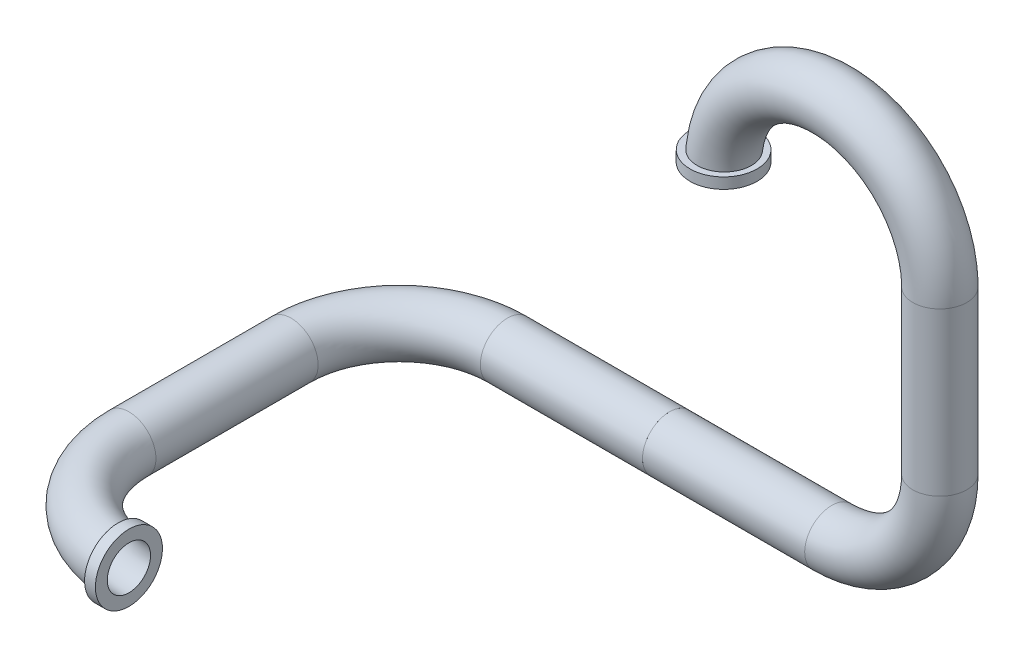
ISO-10303-21;
HEADER;
FILE_DESCRIPTION(('STEP AP214'),'2;1');
FILE_NAME('part.step','',(''),(''),'','','');
FILE_SCHEMA(('AUTOMOTIVE_DESIGN { 1 0 10303 214 1 1 1 1 }'));
ENDSEC;
DATA;
#1=APPLICATION_CONTEXT('core data for automotive mechanical design processes');
#2=APPLICATION_PROTOCOL_DEFINITION('international standard','automotive_design',2000,#1);
#3=PRODUCT_CONTEXT('',#1,'mechanical');
#4=PRODUCT('Part','Part','',(#3));
#5=PRODUCT_RELATED_PRODUCT_CATEGORY('part','',(#4));
#6=PRODUCT_DEFINITION_FORMATION('','',#4);
#7=PRODUCT_DEFINITION_CONTEXT('part definition',#1,'design');
#8=PRODUCT_DEFINITION('design','',#6,#7);
#9=PRODUCT_DEFINITION_SHAPE('','',#8);
#10=(LENGTH_UNIT() NAMED_UNIT(*) SI_UNIT(.MILLI.,.METRE.));
#11=(NAMED_UNIT(*) PLANE_ANGLE_UNIT() SI_UNIT($,.RADIAN.));
#12=(NAMED_UNIT(*) SI_UNIT($,.STERADIAN.) SOLID_ANGLE_UNIT());
#13=UNCERTAINTY_MEASURE_WITH_UNIT(LENGTH_MEASURE(1.E-05),#10,'distance_accuracy_value','');
#14=(GEOMETRIC_REPRESENTATION_CONTEXT(3) GLOBAL_UNCERTAINTY_ASSIGNED_CONTEXT((#13)) GLOBAL_UNIT_ASSIGNED_CONTEXT((#10,
#11,#12)) REPRESENTATION_CONTEXT('',''));
#15=CARTESIAN_POINT('',(0.,0.,0.));
#16=DIRECTION('',(0.,0.,1.));
#17=DIRECTION('',(1.,0.,0.));
#18=AXIS2_PLACEMENT_3D('',#15,#16,#17);
#19=CARTESIAN_POINT('',(-1.,-2.50000000000001,2.5));
#20=DIRECTION('',(0.,1.,0.));
#21=DIRECTION('',(-1.,0.,0.));
#22=AXIS2_PLACEMENT_3D('',#19,#20,#21);
#23=TOROIDAL_SURFACE('',#22,1.,0.25);
#24=CARTESIAN_POINT('',(-2.,-2.50000000000001,2.5));
#25=DIRECTION('',(0.,0.,-1.));
#26=DIRECTION('',(1.,0.,0.));
#27=AXIS2_PLACEMENT_3D('',#24,#25,#26);
#28=CIRCLE('',#27,0.25);
#29=CARTESIAN_POINT('',(-1.75,-2.50000000000001,2.5));
#30=VERTEX_POINT('',#29);
#31=EDGE_CURVE('E69',#30,#30,#28,.T.);
#32=ORIENTED_EDGE('',*,*,#31,.F.);
#33=EDGE_LOOP('',(#32));
#34=FACE_BOUND('',#33,.T.);
#35=CARTESIAN_POINT('',(-1.1,-2.34376036206096,3.29859890368239));
#36=CARTESIAN_POINT('',(-1.1,-2.33274792239043,3.30748461825524));
#37=CARTESIAN_POINT('',(-1.1,-2.32248108378372,3.31731154482602));
#38=CARTESIAN_POINT('',(-1.1,-2.30373626613945,3.33855979360369));
#39=CARTESIAN_POINT('',(-1.1,-2.2952606257197,3.34998316824432));
#40=CARTESIAN_POINT('',(-1.1,-2.28034940835712,3.37408196910666));
#41=CARTESIAN_POINT('',(-1.1,-2.27391241719741,3.386756519343));
#42=CARTESIAN_POINT('',(-1.1,-2.26325207779333,3.41300023448786));
#43=CARTESIAN_POINT('',(-1.1,-2.25902814904259,3.42656916374023));
#44=CARTESIAN_POINT('',(-1.1,-2.25289962356715,3.45426609808908));
#45=CARTESIAN_POINT('',(-1.1,-2.25100235576075,3.46839572582249));
#46=CARTESIAN_POINT('',(-1.1,-2.24960709556757,3.49677370794496));
#47=CARTESIAN_POINT('',(-1.1,-2.25010921596719,3.51102206788375));
#48=CARTESIAN_POINT('',(-1.1,-2.2535017844487,3.53922913334701));
#49=CARTESIAN_POINT('',(-1.1,-2.25639179422017,3.5531878915475));
#50=CARTESIAN_POINT('',(-1.1,-2.26448161295601,3.58041932555232));
#51=CARTESIAN_POINT('',(-1.1,-2.26968138537334,3.59369201220856));
#52=CARTESIAN_POINT('',(-1.1,-2.28222690286051,3.61913001861259));
#53=CARTESIAN_POINT('',(-1.1,-2.28956594273113,3.63129864492456));
#54=CARTESIAN_POINT('',(-1.1,-2.30619061124263,3.65422440361082));
#55=CARTESIAN_POINT('',(-1.1,-2.31547619579665,3.66498156794405));
#56=CARTESIAN_POINT('',(-1.1,-2.33569004284594,3.68473296660521));
#57=CARTESIAN_POINT('',(-1.1,-2.34661152471379,3.69373414042714));
#58=CARTESIAN_POINT('',(-1.1,-2.36981514135202,3.70976742880129));
#59=CARTESIAN_POINT('',(-1.1,-2.38209725081843,3.7167995799634));
#60=CARTESIAN_POINT('',(-1.1,-2.40762676961445,3.72866989147601));
#61=CARTESIAN_POINT('',(-1.1,-2.42087062920436,3.73351568693935));
#62=CARTESIAN_POINT('',(-1.1,-2.44798491254632,3.74090948117469));
#63=CARTESIAN_POINT('',(-1.1,-2.4618553272407,3.74345751315272));
#64=CARTESIAN_POINT('',(-1.1,-2.48979611503258,3.74617903253143));
#65=CARTESIAN_POINT('',(-1.1,-2.50386597816706,3.74635775803878));
#66=CARTESIAN_POINT('',(-1.1,-2.53183570922119,3.7443490557881));
#67=CARTESIAN_POINT('',(-1.1,-2.54573557814848,3.74216164206245));
#68=CARTESIAN_POINT('',(-1.1,-2.57296285317496,3.73548566564956));
#69=CARTESIAN_POINT('',(-1.1,-2.58629057651418,3.73099839651049));
#70=CARTESIAN_POINT('',(-1.1,-2.61200472240836,3.71985250641525));
#71=CARTESIAN_POINT('',(-1.1,-2.62439114251576,3.7131938798134));
#72=CARTESIAN_POINT('',(-1.1,-2.64788721829468,3.69788731542389));
#73=CARTESIAN_POINT('',(-1.1,-2.65899538312406,3.68923708938565));
#74=CARTESIAN_POINT('',(-1.1,-2.67960664012637,3.67019911655826));
#75=CARTESIAN_POINT('',(-1.1,-2.68910971416847,3.65981135014478));
#76=CARTESIAN_POINT('',(-1.1,-2.70626946017411,3.63756371948689));
#77=CARTESIAN_POINT('',(-1.1,-2.7139210530427,3.6256999380033));
#78=CARTESIAN_POINT('',(-1.1,-2.72713254176267,3.6008600065118));
#79=CARTESIAN_POINT('',(-1.1,-2.73269239879531,3.58788383586549));
#80=CARTESIAN_POINT('',(-1.1,-2.74158543201791,3.56113487356717));
#81=CARTESIAN_POINT('',(-1.1,-2.74491006219375,3.54735924079537));
#82=CARTESIAN_POINT('',(-1.1,-2.74920929927144,3.51944604647422));
#83=CARTESIAN_POINT('',(-1.1,-2.75018385138604,3.50530847649482));
#84=CARTESIAN_POINT('',(-1.1,-2.74975817198089,3.4770136765723));
#85=CARTESIAN_POINT('',(-1.1,-2.74834862586144,3.46285658644129));
#86=CARTESIAN_POINT('',(-1.1,-2.74317877425726,3.43497822630541));
#87=CARTESIAN_POINT('',(-1.1,-2.73941842480588,3.42125696445682));
#88=CARTESIAN_POINT('',(-1.1,-2.72964125391774,3.39460613735039));
#89=CARTESIAN_POINT('',(-1.1,-2.72361909393578,3.38167853001149));
#90=CARTESIAN_POINT('',(-1.1,-2.70948750509544,3.35701911324203));
#91=CARTESIAN_POINT('',(-1.1,-2.70137806627134,3.34528730952121));
#92=CARTESIAN_POINT('',(-1.1,-2.68330917267057,3.32337073898221));
#93=CARTESIAN_POINT('',(-1.1,-2.6733519643936,3.31318412058785));
#94=CARTESIAN_POINT('',(-1.1,-2.6518599490962,3.29463870405255));
#95=CARTESIAN_POINT('',(-1.1,-2.64032518394127,3.28627985742117));
#96=CARTESIAN_POINT('',(-1.1,-2.61607486461746,3.27168127958962));
#97=CARTESIAN_POINT('',(-1.1,-2.60336647310675,3.26542965254311));
#98=CARTESIAN_POINT('',(-1.1,-2.57707519918234,3.25516854334938));
#99=CARTESIAN_POINT('',(-1.1,-2.56349239667433,3.25115885665189));
#100=CARTESIAN_POINT('',(-1.1,-2.5359545442265,3.24552688282323));
#101=CARTESIAN_POINT('',(-1.1,-2.52200336275818,3.24388566967865));
#102=CARTESIAN_POINT('',(-1.1,-2.49402044732113,3.24298034692899));
#103=CARTESIAN_POINT('',(-1.1,-2.47998869639818,3.24371675742366));
#104=CARTESIAN_POINT('',(-1.1,-2.45230755732259,3.24753647692591));
#105=CARTESIAN_POINT('',(-1.1,-2.43865686179296,3.25061036534622));
#106=CARTESIAN_POINT('',(-1.1,-2.41207526720781,3.2589995811081));
#107=CARTESIAN_POINT('',(-1.1,-2.39914352376172,3.26431221334144));
#108=CARTESIAN_POINT('',(-1.1,-2.37913230447451,3.27456413039254));
#109=CARTESIAN_POINT('',(-1.1,-2.37171597351397,3.2788601779382));
#110=CARTESIAN_POINT('',(-1.1,-2.35736219612938,3.28818888620585));
#111=CARTESIAN_POINT('',(-1.1,-2.35042474856057,3.29322154516689));
#112=CARTESIAN_POINT('',(-1.1,-2.34376036206096,3.29859890368239));
#113=B_SPLINE_CURVE_WITH_KNOTS('',3,(#35,#36,#37,#38,#39,#40,#41,#42,#43,#44,#45,#46,#47,#48,
#49,#50,#51,#52,#53,#54,#55,#56,#57,#58,#59,#60,#61,#62,#63,#64,#65,#66,#67,#68,#69,#70,#71,#72,
#73,#74,#75,#76,#77,#78,#79,#80,#81,#82,#83,#84,#85,#86,#87,#88,#89,#90,#91,#92,#93,#94,#95,#96,
#97,#98,#99,#100,#101,#102,#103,#104,#105,#106,#107,#108,#109,#110,#111,#112),.UNSPECIFIED.,.T.,
.F.,(4,2,2,2,2,2,2,2,2,2,2,2,2,2,2,2,2,2,2,2,2,2,2,2,2,2,2,2,2,2,2,2,2,2,2,2,2,2,4),(0.,
0.0424192772184804,0.084893600183786,0.127338393721263,0.16977204802275,0.212339026654769,
0.254908006223219,0.297469173753552,0.340029667868764,0.382458171419216,0.424885714119334,
0.467142031024321,0.509397562208715,0.551504365817851,0.593610560912517,0.635623651286503,
0.677636492503143,0.719625729586843,0.761615075846239,0.803652908716628,0.845691216407668,
0.88784357092604,0.929996707675384,0.97231010702195,1.01462449280908,1.05710458176961,
1.09958546525149,1.14216725288102,1.18474924382094,1.22727979920904,1.26980922613231,
1.3120943759003,1.35437566702383,1.39631718923709,1.43826788668425,1.48005040315259,
1.52178276285504,1.54745365347394,1.57312448272488),.UNSPECIFIED.);
#114=CARTESIAN_POINT('',(-1.1,-2.34376036206096,3.29859890368239));
#115=VERTEX_POINT('',#114);
#116=EDGE_CURVE('E12',#115,#115,#113,.T.);
#117=ORIENTED_EDGE('',*,*,#116,.F.);
#118=EDGE_LOOP('',(#117));
#119=FACE_BOUND('',#118,.T.);
#120=ADVANCED_FACE('F39',(#34,#119),#23,.T.);
#121=CARTESIAN_POINT('',(0.5,-2.50000000000001,2.5));
#122=DIRECTION('',(1.,0.,0.));
#123=DIRECTION('',(0.,1.,0.));
#124=AXIS2_PLACEMENT_3D('',#121,#122,#123);
#125=PLANE('',#124);
#126=CARTESIAN_POINT('',(0.5,-2.5,0.));
#127=DIRECTION('',(1.,0.,0.));
#128=DIRECTION('',(0.,1.,0.));
#129=AXIS2_PLACEMENT_3D('',#126,#127,#128);
#130=CIRCLE('',#129,0.2);
#131=CARTESIAN_POINT('',(0.5,-2.3,0.));
#132=VERTEX_POINT('',#131);
#133=EDGE_CURVE('E59',#132,#132,#130,.F.);
#134=ORIENTED_EDGE('',*,*,#133,.T.);
#135=EDGE_LOOP('',(#134));
#136=FACE_BOUND('',#135,.T.);
#137=CARTESIAN_POINT('',(0.5,-2.5,0.));
#138=DIRECTION('',(1.,0.,0.));
#139=DIRECTION('',(0.,1.,0.));
#140=AXIS2_PLACEMENT_3D('',#137,#138,#139);
#141=CIRCLE('',#140,0.25);
#142=CARTESIAN_POINT('',(0.5,-2.25,0.));
#143=VERTEX_POINT('',#142);
#144=EDGE_CURVE('E54',#143,#143,#141,.F.);
#145=ORIENTED_EDGE('',*,*,#144,.F.);
#146=EDGE_LOOP('',(#145));
#147=FACE_BOUND('',#146,.T.);
#148=ADVANCED_FACE('F116',(#136,#147),#125,.T.);
#149=CARTESIAN_POINT('',(-1.,-2.5,0.));
#150=DIRECTION('',(1.,0.,0.));
#151=DIRECTION('',(0.,0.,1.));
#152=AXIS2_PLACEMENT_3D('',#149,#150,#151);
#153=CYLINDRICAL_SURFACE('',#152,0.25);
#154=CARTESIAN_POINT('',(-1.,-2.5,0.));
#155=DIRECTION('',(1.,0.,0.));
#156=DIRECTION('',(0.,0.,1.));
#157=AXIS2_PLACEMENT_3D('',#154,#155,#156);
#158=CIRCLE('',#157,0.25);
#159=CARTESIAN_POINT('',(-1.,-2.5,-0.25));
#160=VERTEX_POINT('',#159);
#161=EDGE_CURVE('E78',#160,#160,#158,.T.);
#162=ORIENTED_EDGE('',*,*,#161,.T.);
#163=EDGE_LOOP('',(#162));
#164=FACE_BOUND('',#163,.T.);
#165=ORIENTED_EDGE('',*,*,#144,.T.);
#166=EDGE_LOOP('',(#165));
#167=FACE_BOUND('',#166,.T.);
#168=ADVANCED_FACE('F121',(#164,#167),#153,.T.);
#169=CARTESIAN_POINT('',(-1.,-2.5,0.));
#170=DIRECTION('',(1.,0.,0.));
#171=DIRECTION('',(0.,0.,1.));
#172=AXIS2_PLACEMENT_3D('',#169,#170,#171);
#173=CYLINDRICAL_SURFACE('',#172,0.2);
#174=CARTESIAN_POINT('',(-1.,-2.5,0.));
#175=DIRECTION('',(1.,0.,0.));
#176=DIRECTION('',(0.,-1.,0.));
#177=AXIS2_PLACEMENT_3D('',#174,#175,#176);
#178=CIRCLE('',#177,0.2);
#179=CARTESIAN_POINT('',(-1.,-2.5,-0.2));
#180=VERTEX_POINT('',#179);
#181=EDGE_CURVE('E50',#180,#180,#178,.T.);
#182=ORIENTED_EDGE('',*,*,#181,.F.);
#183=EDGE_LOOP('',(#182));
#184=FACE_BOUND('',#183,.T.);
#185=ORIENTED_EDGE('',*,*,#133,.F.);
#186=EDGE_LOOP('',(#185));
#187=FACE_BOUND('',#186,.T.);
#188=ADVANCED_FACE('F41',(#184,#187),#173,.F.);
#189=CARTESIAN_POINT('',(-1.,-2.50000000000001,2.5));
#190=DIRECTION('',(1.,0.,0.));
#191=DIRECTION('',(0.,1.,0.));
#192=AXIS2_PLACEMENT_3D('',#189,#190,#191);
#193=PLANE('',#192);
#194=CARTESIAN_POINT('',(-1.,-2.50000000000001,3.5));
#195=DIRECTION('',(1.,0.,0.));
#196=DIRECTION('',(0.,1.,0.));
#197=AXIS2_PLACEMENT_3D('',#194,#195,#196);
#198=CIRCLE('',#197,0.31);
#199=CARTESIAN_POINT('',(-1.,-2.19000000000001,3.5));
#200=VERTEX_POINT('',#199);
#201=EDGE_CURVE('E86',#200,#200,#198,.T.);
#202=ORIENTED_EDGE('',*,*,#201,.T.);
#203=EDGE_LOOP('',(#202));
#204=FACE_BOUND('',#203,.T.);
#205=CARTESIAN_POINT('',(-1.,-2.50000000000001,3.5));
#206=DIRECTION('',(1.,0.,0.));
#207=DIRECTION('',(0.,1.,0.));
#208=AXIS2_PLACEMENT_3D('',#205,#206,#207);
#209=CIRCLE('',#208,0.2);
#210=CARTESIAN_POINT('',(-1.,-2.50000000000001,3.7));
#211=VERTEX_POINT('',#210);
#212=EDGE_CURVE('E62',#211,#211,#209,.T.);
#213=ORIENTED_EDGE('',*,*,#212,.F.);
#214=EDGE_LOOP('',(#213));
#215=FACE_BOUND('',#214,.T.);
#216=ADVANCED_FACE('F110',(#204,#215),#193,.T.);
#217=CARTESIAN_POINT('',(-2.,-2.50000000000001,2.5));
#218=DIRECTION('',(0.,0.,-1.));
#219=DIRECTION('',(1.,0.,0.));
#220=AXIS2_PLACEMENT_3D('',#217,#218,#219);
#221=CYLINDRICAL_SURFACE('',#220,0.25);
#222=ORIENTED_EDGE('',*,*,#31,.T.);
#223=EDGE_LOOP('',(#222));
#224=FACE_BOUND('',#223,.T.);
#225=CARTESIAN_POINT('',(-2.,-2.5,1.));
#226=DIRECTION('',(0.,0.,1.));
#227=DIRECTION('',(-1.,0.,0.));
#228=AXIS2_PLACEMENT_3D('',#225,#226,#227);
#229=CIRCLE('',#228,0.25);
#230=CARTESIAN_POINT('',(-2.25,-2.5,1.));
#231=VERTEX_POINT('',#230);
#232=EDGE_CURVE('E65',#231,#231,#229,.F.);
#233=ORIENTED_EDGE('',*,*,#232,.F.);
#234=EDGE_LOOP('',(#233));
#235=FACE_BOUND('',#234,.T.);
#236=ADVANCED_FACE('F123',(#224,#235),#221,.T.);
#237=CARTESIAN_POINT('',(-1.,-2.5,1.));
#238=DIRECTION('',(0.,-1.,0.));
#239=DIRECTION('',(1.,0.,0.));
#240=AXIS2_PLACEMENT_3D('',#237,#238,#239);
#241=TOROIDAL_SURFACE('',#240,1.,0.25);
#242=CARTESIAN_POINT('',(-1.,-2.5,1.));
#243=DIRECTION('',(0.,-1.,0.));
#244=DIRECTION('',(1.,0.,0.));
#245=AXIS2_PLACEMENT_3D('',#242,#243,#244);
#246=CIRCLE('',#245,1.25);
#247=EDGE_CURVE('',#231,#160,#246,.T.);
#248=ORIENTED_EDGE('',*,*,#232,.T.);
#249=ORIENTED_EDGE('',*,*,#161,.F.);
#250=ORIENTED_EDGE('',*,*,#247,.T.);
#251=ORIENTED_EDGE('',*,*,#247,.F.);
#252=EDGE_LOOP('',(#248,#250,#249,#251));
#253=FACE_BOUND('',#252,.T.);
#254=ADVANCED_FACE('F111',(#253),#241,.T.);
#255=CARTESIAN_POINT('',(-2.,-2.50000000000001,2.5));
#256=DIRECTION('',(0.,0.,-1.));
#257=DIRECTION('',(1.,0.,0.));
#258=AXIS2_PLACEMENT_3D('',#255,#256,#257);
#259=CYLINDRICAL_SURFACE('',#258,0.2);
#260=CARTESIAN_POINT('',(-2.,-2.50000000000001,2.5));
#261=DIRECTION('',(0.,0.,-1.));
#262=DIRECTION('',(0.,-1.,0.));
#263=AXIS2_PLACEMENT_3D('',#260,#261,#262);
#264=CIRCLE('',#263,0.2);
#265=CARTESIAN_POINT('',(-2.2,-2.50000000000001,2.5));
#266=VERTEX_POINT('',#265);
#267=EDGE_CURVE('E84',#266,#266,#264,.T.);
#268=ORIENTED_EDGE('',*,*,#267,.F.);
#269=EDGE_LOOP('',(#268));
#270=FACE_BOUND('',#269,.T.);
#271=CARTESIAN_POINT('',(-2.,-2.5,1.));
#272=DIRECTION('',(0.,0.,-1.));
#273=DIRECTION('',(0.,-1.,0.));
#274=AXIS2_PLACEMENT_3D('',#271,#272,#273);
#275=CIRCLE('',#274,0.2);
#276=CARTESIAN_POINT('',(-2.2,-2.5,1.));
#277=VERTEX_POINT('',#276);
#278=EDGE_CURVE('E74',#277,#277,#275,.T.);
#279=ORIENTED_EDGE('',*,*,#278,.T.);
#280=EDGE_LOOP('',(#279));
#281=FACE_BOUND('',#280,.T.);
#282=ADVANCED_FACE('F98',(#270,#281),#259,.F.);
#283=CARTESIAN_POINT('',(-1.,-2.5,1.));
#284=DIRECTION('',(0.,-1.,0.));
#285=DIRECTION('',(1.,0.,0.));
#286=AXIS2_PLACEMENT_3D('',#283,#284,#285);
#287=TOROIDAL_SURFACE('',#286,1.,0.2);
#288=CARTESIAN_POINT('',(-1.,-2.5,1.));
#289=DIRECTION('',(0.,-1.,0.));
#290=DIRECTION('',(1.,0.,0.));
#291=AXIS2_PLACEMENT_3D('',#288,#289,#290);
#292=CIRCLE('',#291,1.2);
#293=EDGE_CURVE('',#277,#180,#292,.T.);
#294=ORIENTED_EDGE('',*,*,#278,.F.);
#295=ORIENTED_EDGE('',*,*,#181,.T.);
#296=ORIENTED_EDGE('',*,*,#293,.T.);
#297=ORIENTED_EDGE('',*,*,#293,.F.);
#298=EDGE_LOOP('',(#294,#296,#295,#297));
#299=FACE_BOUND('',#298,.T.);
#300=ADVANCED_FACE('F100',(#299),#287,.F.);
#301=CARTESIAN_POINT('',(-1.,-2.50000000000001,2.5));
#302=DIRECTION('',(0.,1.,0.));
#303=DIRECTION('',(-1.,0.,0.));
#304=AXIS2_PLACEMENT_3D('',#301,#302,#303);
#305=TOROIDAL_SURFACE('',#304,1.,0.2);
#306=CARTESIAN_POINT('',(-1.,-2.50000000000001,2.5));
#307=DIRECTION('',(0.,1.,0.));
#308=DIRECTION('',(-1.,0.,0.));
#309=AXIS2_PLACEMENT_3D('',#306,#307,#308);
#310=CIRCLE('',#309,1.2);
#311=EDGE_CURVE('',#266,#211,#310,.T.);
#312=ORIENTED_EDGE('',*,*,#267,.T.);
#313=ORIENTED_EDGE('',*,*,#212,.T.);
#314=ORIENTED_EDGE('',*,*,#311,.T.);
#315=ORIENTED_EDGE('',*,*,#311,.F.);
#316=EDGE_LOOP('',(#312,#314,#313,#315));
#317=FACE_BOUND('',#316,.T.);
#318=ADVANCED_FACE('F102',(#317),#305,.F.);
#319=CARTESIAN_POINT('',(-1.1,-2.50000000000001,3.5));
#320=DIRECTION('',(1.,0.,0.));
#321=DIRECTION('',(0.,1.,0.));
#322=AXIS2_PLACEMENT_3D('',#319,#320,#321);
#323=PLANE('',#322);
#324=CARTESIAN_POINT('',(-1.1,-2.50000000000001,3.5));
#325=DIRECTION('',(1.,0.,0.));
#326=DIRECTION('',(0.,1.,0.));
#327=AXIS2_PLACEMENT_3D('',#324,#325,#326);
#328=CIRCLE('',#327,0.31);
#329=CARTESIAN_POINT('',(-1.1,-2.19000000000001,3.5));
#330=VERTEX_POINT('',#329);
#331=EDGE_CURVE('E80',#330,#330,#328,.T.);
#332=ORIENTED_EDGE('',*,*,#331,.F.);
#333=EDGE_LOOP('',(#332));
#334=FACE_BOUND('',#333,.T.);
#335=ORIENTED_EDGE('',*,*,#116,.T.);
#336=EDGE_LOOP('',(#335));
#337=FACE_BOUND('',#336,.T.);
#338=ADVANCED_FACE('F108',(#334,#337),#323,.F.);
#339=CARTESIAN_POINT('',(-1.1,-2.50000000000001,3.5));
#340=DIRECTION('',(1.,0.,0.));
#341=DIRECTION('',(0.,1.,0.));
#342=AXIS2_PLACEMENT_3D('',#339,#340,#341);
#343=CYLINDRICAL_SURFACE('',#342,0.31);
#344=ORIENTED_EDGE('',*,*,#331,.T.);
#345=EDGE_LOOP('',(#344));
#346=FACE_BOUND('',#345,.T.);
#347=ORIENTED_EDGE('',*,*,#201,.F.);
#348=EDGE_LOOP('',(#347));
#349=FACE_BOUND('',#348,.T.);
#350=ADVANCED_FACE('F208',(#346,#349),#343,.T.);
#351=CLOSED_SHELL('',(#120,#148,#168,#188,#216,#236,#254,#282,#300,#318,#338,#350));
#352=MANIFOLD_SOLID_BREP('B2',#351);
#353=CARTESIAN_POINT('',(0.5,0.,0.));
#354=DIRECTION('',(1.,0.,0.));
#355=DIRECTION('',(0.,0.,-1.));
#356=AXIS2_PLACEMENT_3D('',#353,#354,#355);
#357=PLANE('',#356);
#358=CARTESIAN_POINT('',(0.5,-2.5,0.));
#359=DIRECTION('',(1.,0.,0.));
#360=DIRECTION('',(0.,0.,-1.));
#361=AXIS2_PLACEMENT_3D('',#358,#359,#360);
#362=CIRCLE('',#361,0.25);
#363=CARTESIAN_POINT('',(0.5,-2.5,-0.25));
#364=VERTEX_POINT('',#363);
#365=EDGE_CURVE('E38',#364,#364,#362,.F.);
#366=ORIENTED_EDGE('',*,*,#365,.T.);
#367=EDGE_LOOP('',(#366));
#368=FACE_BOUND('',#367,.T.);
#369=CARTESIAN_POINT('',(0.5,-2.5,0.));
#370=DIRECTION('',(1.,0.,0.));
#371=DIRECTION('',(0.,0.,-1.));
#372=AXIS2_PLACEMENT_3D('',#369,#370,#371);
#373=CIRCLE('',#372,0.2);
#374=CARTESIAN_POINT('',(0.5,-2.5,-0.2));
#375=VERTEX_POINT('',#374);
#376=EDGE_CURVE('E239',#375,#375,#373,.F.);
#377=ORIENTED_EDGE('',*,*,#376,.F.);
#378=EDGE_LOOP('',(#377));
#379=FACE_BOUND('',#378,.T.);
#380=ADVANCED_FACE('F233',(#368,#379),#357,.F.);
#381=CARTESIAN_POINT('',(-1.,-2.5,0.));
#382=DIRECTION('',(1.,0.,0.));
#383=DIRECTION('',(0.,1.,0.));
#384=AXIS2_PLACEMENT_3D('',#381,#382,#383);
#385=CYLINDRICAL_SURFACE('',#384,0.25);
#386=ORIENTED_EDGE('',*,*,#365,.F.);
#387=EDGE_LOOP('',(#386));
#388=FACE_BOUND('',#387,.T.);
#389=CARTESIAN_POINT('',(2.,-2.5,0.));
#390=DIRECTION('',(1.,0.,0.));
#391=DIRECTION('',(0.,1.,0.));
#392=AXIS2_PLACEMENT_3D('',#389,#390,#391);
#393=CIRCLE('',#392,0.25);
#394=CARTESIAN_POINT('',(2.,-2.75,0.));
#395=VERTEX_POINT('',#394);
#396=EDGE_CURVE('E243',#395,#395,#393,.T.);
#397=ORIENTED_EDGE('',*,*,#396,.F.);
#398=EDGE_LOOP('',(#397));
#399=FACE_BOUND('',#398,.T.);
#400=ADVANCED_FACE('F276',(#388,#399),#385,.T.);
#401=CARTESIAN_POINT('',(1.,0.,0.));
#402=DIRECTION('',(0.,1.,0.));
#403=DIRECTION('',(0.,0.,1.));
#404=AXIS2_PLACEMENT_3D('',#401,#402,#403);
#405=PLANE('',#404);
#406=CARTESIAN_POINT('',(1.,0.,0.));
#407=DIRECTION('',(0.,-1.,0.));
#408=DIRECTION('',(0.,0.,1.));
#409=AXIS2_PLACEMENT_3D('',#406,#407,#408);
#410=CIRCLE('',#409,0.2);
#411=CARTESIAN_POINT('',(0.800000000000001,0.,0.));
#412=VERTEX_POINT('',#411);
#413=EDGE_CURVE('E257',#412,#412,#410,.T.);
#414=ORIENTED_EDGE('',*,*,#413,.F.);
#415=EDGE_LOOP('',(#414));
#416=FACE_BOUND('',#415,.T.);
#417=CARTESIAN_POINT('',(1.,0.,0.));
#418=DIRECTION('',(0.,-1.,0.));
#419=DIRECTION('',(0.,0.,1.));
#420=AXIS2_PLACEMENT_3D('',#417,#418,#419);
#421=CIRCLE('',#420,0.31);
#422=CARTESIAN_POINT('',(1.,0.,0.31));
#423=VERTEX_POINT('',#422);
#424=EDGE_CURVE('E320',#423,#423,#421,.T.);
#425=ORIENTED_EDGE('',*,*,#424,.T.);
#426=EDGE_LOOP('',(#425));
#427=FACE_BOUND('',#426,.T.);
#428=ADVANCED_FACE('F278',(#416,#427),#405,.F.);
#429=CARTESIAN_POINT('',(2.,0.,0.));
#430=DIRECTION('',(0.,0.,-1.));
#431=DIRECTION('',(1.,0.,0.));
#432=AXIS2_PLACEMENT_3D('',#429,#430,#431);
#433=TOROIDAL_SURFACE('',#432,1.,0.2);
#434=CARTESIAN_POINT('',(3.,0.,0.));
#435=DIRECTION('',(0.,1.,0.));
#436=DIRECTION('',(0.,0.,1.));
#437=AXIS2_PLACEMENT_3D('',#434,#435,#436);
#438=CIRCLE('',#437,0.2);
#439=CARTESIAN_POINT('',(3.2,0.,0.));
#440=VERTEX_POINT('',#439);
#441=EDGE_CURVE('E327',#440,#440,#438,.T.);
#442=CARTESIAN_POINT('',(2.,0.,0.));
#443=DIRECTION('',(0.,0.,-1.));
#444=DIRECTION('',(1.,0.,0.));
#445=AXIS2_PLACEMENT_3D('',#442,#443,#444);
#446=CIRCLE('',#445,1.2);
#447=EDGE_CURVE('',#412,#440,#446,.T.);
#448=ORIENTED_EDGE('',*,*,#413,.T.);
#449=ORIENTED_EDGE('',*,*,#441,.F.);
#450=ORIENTED_EDGE('',*,*,#447,.T.);
#451=ORIENTED_EDGE('',*,*,#447,.F.);
#452=EDGE_LOOP('',(#448,#450,#449,#451));
#453=FACE_BOUND('',#452,.T.);
#454=ADVANCED_FACE('F285',(#453),#433,.F.);
#455=CARTESIAN_POINT('',(3.,0.,0.));
#456=DIRECTION('',(0.,-1.,0.));
#457=DIRECTION('',(-1.,0.,0.));
#458=AXIS2_PLACEMENT_3D('',#455,#456,#457);
#459=CYLINDRICAL_SURFACE('',#458,0.2);
#460=ORIENTED_EDGE('',*,*,#441,.T.);
#461=EDGE_LOOP('',(#460));
#462=FACE_BOUND('',#461,.T.);
#463=CARTESIAN_POINT('',(3.,-1.5,0.));
#464=DIRECTION('',(0.,1.,0.));
#465=DIRECTION('',(0.,0.,1.));
#466=AXIS2_PLACEMENT_3D('',#463,#464,#465);
#467=CIRCLE('',#466,0.2);
#468=CARTESIAN_POINT('',(3.2,-1.5,0.));
#469=VERTEX_POINT('',#468);
#470=EDGE_CURVE('E330',#469,#469,#467,.T.);
#471=ORIENTED_EDGE('',*,*,#470,.F.);
#472=EDGE_LOOP('',(#471));
#473=FACE_BOUND('',#472,.T.);
#474=ADVANCED_FACE('F301',(#462,#473),#459,.F.);
#475=CARTESIAN_POINT('',(2.,-1.5,0.));
#476=DIRECTION('',(0.,0.,1.));
#477=DIRECTION('',(-1.,0.,0.));
#478=AXIS2_PLACEMENT_3D('',#475,#476,#477);
#479=TOROIDAL_SURFACE('',#478,1.,0.2);
#480=CARTESIAN_POINT('',(2.,-2.5,0.));
#481=DIRECTION('',(1.,0.,0.));
#482=DIRECTION('',(0.,0.,1.));
#483=AXIS2_PLACEMENT_3D('',#480,#481,#482);
#484=CIRCLE('',#483,0.2);
#485=CARTESIAN_POINT('',(2.,-2.7,0.));
#486=VERTEX_POINT('',#485);
#487=EDGE_CURVE('E333',#486,#486,#484,.T.);
#488=CARTESIAN_POINT('',(2.,-1.5,0.));
#489=DIRECTION('',(0.,0.,1.));
#490=DIRECTION('',(-1.,0.,0.));
#491=AXIS2_PLACEMENT_3D('',#488,#489,#490);
#492=CIRCLE('',#491,1.2);
#493=EDGE_CURVE('',#486,#469,#492,.T.);
#494=ORIENTED_EDGE('',*,*,#487,.F.);
#495=ORIENTED_EDGE('',*,*,#470,.T.);
#496=ORIENTED_EDGE('',*,*,#493,.T.);
#497=ORIENTED_EDGE('',*,*,#493,.F.);
#498=EDGE_LOOP('',(#494,#496,#495,#497));
#499=FACE_BOUND('',#498,.T.);
#500=ADVANCED_FACE('F275',(#499),#479,.F.);
#501=CARTESIAN_POINT('',(-1.,-2.5,0.));
#502=DIRECTION('',(1.,0.,0.));
#503=DIRECTION('',(0.,1.,0.));
#504=AXIS2_PLACEMENT_3D('',#501,#502,#503);
#505=CYLINDRICAL_SURFACE('',#504,0.2);
#506=ORIENTED_EDGE('',*,*,#376,.T.);
#507=EDGE_LOOP('',(#506));
#508=FACE_BOUND('',#507,.T.);
#509=ORIENTED_EDGE('',*,*,#487,.T.);
#510=EDGE_LOOP('',(#509));
#511=FACE_BOUND('',#510,.T.);
#512=ADVANCED_FACE('F272',(#508,#511),#505,.F.);
#513=CARTESIAN_POINT('',(1.,0.0999999999999996,0.));
#514=DIRECTION('',(0.,-1.,0.));
#515=DIRECTION('',(0.,0.,-1.));
#516=AXIS2_PLACEMENT_3D('',#513,#514,#515);
#517=CYLINDRICAL_SURFACE('',#516,0.31);
#518=CARTESIAN_POINT('',(1.,0.0999999999999996,0.));
#519=DIRECTION('',(0.,-1.,0.));
#520=DIRECTION('',(0.,0.,1.));
#521=AXIS2_PLACEMENT_3D('',#518,#519,#520);
#522=CIRCLE('',#521,0.31);
#523=CARTESIAN_POINT('',(1.,0.0999999999999996,0.31));
#524=VERTEX_POINT('',#523);
#525=EDGE_CURVE('E258',#524,#524,#522,.T.);
#526=ORIENTED_EDGE('',*,*,#525,.T.);
#527=EDGE_LOOP('',(#526));
#528=FACE_BOUND('',#527,.T.);
#529=ORIENTED_EDGE('',*,*,#424,.F.);
#530=EDGE_LOOP('',(#529));
#531=FACE_BOUND('',#530,.T.);
#532=ADVANCED_FACE('F274',(#528,#531),#517,.T.);
#533=CARTESIAN_POINT('',(1.,0.0999999999999996,0.));
#534=DIRECTION('',(0.,1.,0.));
#535=DIRECTION('',(0.,0.,1.));
#536=AXIS2_PLACEMENT_3D('',#533,#534,#535);
#537=PLANE('',#536);
#538=ORIENTED_EDGE('',*,*,#525,.F.);
#539=EDGE_LOOP('',(#538));
#540=FACE_BOUND('',#539,.T.);
#541=CARTESIAN_POINT('',(1.20140109631761,0.0999999999999994,-0.156239637939055));
#542=CARTESIAN_POINT('',(1.21019061571474,0.0999999999999994,-0.145344468335609));
#543=CARTESIAN_POINT('',(1.21807172210946,0.0999999999999994,-0.133703962300581));
#544=CARTESIAN_POINT('',(1.23177790310757,0.0999999999999994,-0.109257379143088));
#545=CARTESIAN_POINT('',(1.237600690406,0.0999999999999994,-0.096450025107835));
#546=CARTESIAN_POINT('',(1.24700765016561,0.0999999999999994,-0.0700386597896411));
#547=CARTESIAN_POINT('',(1.25059219436236,0.0999999999999994,-0.0564347812071185));
#548=CARTESIAN_POINT('',(1.25541318839992,0.0999999999999994,-0.0288206461573356));
#549=CARTESIAN_POINT('',(1.25665023046536,0.0999999999999994,-0.014810493090211));
#550=CARTESIAN_POINT('',(1.25674012956133,0.0999999999999994,0.0131538110387401));
#551=CARTESIAN_POINT('',(1.25560376128764,0.0999999999999994,0.0271079282969863));
#552=CARTESIAN_POINT('',(1.25100317267413,0.0999999999999994,0.0546272137432173));
#553=CARTESIAN_POINT('',(1.24753888231816,0.0999999999999994,0.0681923702197628));
#554=CARTESIAN_POINT('',(1.23838863374503,0.0999999999999994,0.0945453892648773));
#555=CARTESIAN_POINT('',(1.23270348712941,0.0999999999999994,0.107333533818285));
#556=CARTESIAN_POINT('',(1.21927977306228,0.0999999999999994,0.131782096781474));
#557=CARTESIAN_POINT('',(1.21154114762927,0.0999999999999994,0.143442483335476));
#558=CARTESIAN_POINT('',(1.19418083260693,0.0999999999999995,0.16538311643698));
#559=CARTESIAN_POINT('',(1.18454778916345,0.0999999999999995,0.175654378083549));
#560=CARTESIAN_POINT('',(1.16370586490868,0.0999999999999995,0.194449314988614));
#561=CARTESIAN_POINT('',(1.15249692087162,0.0999999999999995,0.202972920096664));
#562=CARTESIAN_POINT('',(1.12872743217782,0.0999999999999995,0.218098495866874));
#563=CARTESIAN_POINT('',(1.11615711045901,0.0999999999999995,0.224685104803622));
#564=CARTESIAN_POINT('',(1.09009255829582,0.0999999999999995,0.235665425768117));
#565=CARTESIAN_POINT('',(1.07659830142009,0.0999999999999995,0.240059075031189));
#566=CARTESIAN_POINT('',(1.0490037254833,0.0999999999999996,0.246545191192852));
#567=CARTESIAN_POINT('',(1.03490096979586,0.0999999999999996,0.248627297728038));
#568=CARTESIAN_POINT('',(1.00654593496887,0.0999999999999996,0.250394447161815));
#569=CARTESIAN_POINT('',(0.992293655189753,0.0999999999999996,0.250079479803207));
#570=CARTESIAN_POINT('',(0.964044783835867,0.0999999999999996,0.247058139402245));
#571=CARTESIAN_POINT('',(0.95004818958155,0.0999999999999996,0.244351791435899));
#572=CARTESIAN_POINT('',(0.922710586450209,0.0999999999999997,0.236620477359455));
#573=CARTESIAN_POINT('',(0.909369569109577,0.0999999999999997,0.23159554119143));
#574=CARTESIAN_POINT('',(0.883765586512359,0.0999999999999997,0.219384869006445));
#575=CARTESIAN_POINT('',(0.871499478830634,0.0999999999999997,0.212205722852414));
#576=CARTESIAN_POINT('',(0.848353160880975,0.0999999999999997,0.195882113872184));
#577=CARTESIAN_POINT('',(0.837472922002869,0.0999999999999997,0.186737691628039));
#578=CARTESIAN_POINT('',(0.817453819567474,0.0999999999999997,0.166782766405174));
#579=CARTESIAN_POINT('',(0.808308112284606,0.0999999999999997,0.155979129073377));
#580=CARTESIAN_POINT('',(0.791968057395513,0.0999999999999998,0.132985122648441));
#581=CARTESIAN_POINT('',(0.784773671079474,0.0999999999999998,0.120794781071202));
#582=CARTESIAN_POINT('',(0.772566712871766,0.0999999999999998,0.095420262938804));
#583=CARTESIAN_POINT('',(0.767546469379715,0.0999999999999998,0.0822397766594054));
#584=CARTESIAN_POINT('',(0.759795746832072,0.0999999999999998,0.0552219448415193));
#585=CARTESIAN_POINT('',(0.757065234762672,0.0999999999999998,0.0413846087766634));
#586=CARTESIAN_POINT('',(0.753976519279488,0.0999999999999998,0.013479573995303));
#587=CARTESIAN_POINT('',(0.753612942574423,0.0999999999999998,-0.000587530219673126));
#588=CARTESIAN_POINT('',(0.755254272349145,0.0999999999999998,-0.0285828177191339));
#589=CARTESIAN_POINT('',(0.757259164603744,0.0999999999999998,-0.0425110018374756));
#590=CARTESIAN_POINT('',(0.763577570254616,0.0999999999999998,-0.069824146498636));
#591=CARTESIAN_POINT('',(0.76788963229582,0.0999999999999998,-0.0832094428634802));
#592=CARTESIAN_POINT('',(0.778697386164953,0.0999999999999998,-0.109067212165587));
#593=CARTESIAN_POINT('',(0.785193080784411,0.0999999999999998,-0.121539683935882));
#594=CARTESIAN_POINT('',(0.800190008892191,0.0999999999999997,-0.145233133026621));
#595=CARTESIAN_POINT('',(0.808693418744189,0.0999999999999997,-0.156452732655624));
#596=CARTESIAN_POINT('',(0.827458597227383,0.0999999999999997,-0.177309784421281));
#597=CARTESIAN_POINT('',(0.837720388123736,0.0999999999999997,-0.18694721652102));
#598=CARTESIAN_POINT('',(0.859739463821489,0.0999999999999997,-0.20439458897411));
#599=CARTESIAN_POINT('',(0.871500649143087,0.0999999999999997,-0.212199606378334));
#600=CARTESIAN_POINT('',(0.896162545480009,0.0999999999999997,-0.225732886882564));
#601=CARTESIAN_POINT('',(0.909063279872268,0.0999999999999997,-0.231461107366438));
#602=CARTESIAN_POINT('',(0.935690177297002,0.0999999999999997,-0.240701650163389));
#603=CARTESIAN_POINT('',(0.949419285126398,0.0999999999999996,-0.244205486570355));
#604=CARTESIAN_POINT('',(0.977269513121592,0.0999999999999996,-0.248868281721869));
#605=CARTESIAN_POINT('',(0.991390626994743,0.0999999999999996,-0.250027278084741));
#606=CARTESIAN_POINT('',(1.01968231033146,0.0999999999999996,-0.249971637934856));
#607=CARTESIAN_POINT('',(1.03385286183813,0.0999999999999996,-0.248747884057992));
#608=CARTESIAN_POINT('',(1.06179290963795,0.0999999999999995,-0.243944388235435));
#609=CARTESIAN_POINT('',(1.07556229838005,0.0999999999999995,-0.240364020446176));
#610=CARTESIAN_POINT('',(1.10234573174545,0.0999999999999995,-0.230935097081438));
#611=CARTESIAN_POINT('',(1.1153574306868,0.0999999999999995,-0.225079887987269));
#612=CARTESIAN_POINT('',(1.14020018687569,0.0999999999999995,-0.211269182973001));
#613=CARTESIAN_POINT('',(1.15203262501892,0.0999999999999995,-0.203316184310893));
#614=CARTESIAN_POINT('',(1.17015055889538,0.0999999999999995,-0.188776882063845));
#615=CARTESIAN_POINT('',(1.17688861698793,0.0999999999999995,-0.182745072414765));
#616=CARTESIAN_POINT('',(1.18967760471602,0.0999999999999995,-0.169992202553551));
#617=CARTESIAN_POINT('',(1.19572853335573,0.0999999999999994,-0.163271141342544));
#618=CARTESIAN_POINT('',(1.20140109631761,0.0999999999999994,-0.156239637939055));
#619=B_SPLINE_CURVE_WITH_KNOTS('',3,(#541,#542,#543,#544,#545,#546,#547,#548,#549,#550,#551,
#552,#553,#554,#555,#556,#557,#558,#559,#560,#561,#562,#563,#564,#565,#566,#567,#568,#569,#570,
#571,#572,#573,#574,#575,#576,#577,#578,#579,#580,#581,#582,#583,#584,#585,#586,#587,#588,#589,
#590,#591,#592,#593,#594,#595,#596,#597,#598,#599,#600,#601,#602,#603,#604,#605,#606,#607,#608,
#609,#610,#611,#612,#613,#614,#615,#616,#617,#618),.UNSPECIFIED.,.T.,.F.,(4,2,2,2,2,2,2,2,2,2,2,
2,2,2,2,2,2,2,2,2,2,2,2,2,2,2,2,2,2,2,2,2,2,2,2,2,2,2,4),(0.,0.0419631052503928,
0.0839726964411998,0.125975308668973,0.167967323125762,0.209769118662524,0.251572171514233,
0.293359961905662,0.335148932332196,0.377196440897467,0.419245636907758,0.461619835954524,
0.503995247723258,0.54655982933734,0.589124593087474,0.631688910508933,0.6742526782734,
0.716687545691694,0.759121536933536,0.801384450217337,0.843646525038764,0.88575823574167,
0.927869339259047,0.969884810944665,1.01190003028372,1.05388885042508,1.09587772424463,
1.13791232469054,1.17994745743075,1.22209426111071,1.26424192959939,1.30654943795309,
1.34885626756105,1.39132529833847,1.43380561212635,1.47641112039157,1.51896613717817,
1.5460481653165,1.57313023270311),.UNSPECIFIED.);
#620=CARTESIAN_POINT('',(1.20140109631761,0.0999999999999994,-0.156239637939055));
#621=VERTEX_POINT('',#620);
#622=EDGE_CURVE('E250',#621,#621,#619,.T.);
#623=ORIENTED_EDGE('',*,*,#622,.T.);
#624=EDGE_LOOP('',(#623));
#625=FACE_BOUND('',#624,.T.);
#626=ADVANCED_FACE('F261',(#540,#625),#537,.T.);
#627=CARTESIAN_POINT('',(2.,0.,0.));
#628=DIRECTION('',(0.,0.,-1.));
#629=DIRECTION('',(1.,0.,0.));
#630=AXIS2_PLACEMENT_3D('',#627,#628,#629);
#631=TOROIDAL_SURFACE('',#630,1.,0.25);
#632=ORIENTED_EDGE('',*,*,#622,.F.);
#633=EDGE_LOOP('',(#632));
#634=FACE_BOUND('',#633,.T.);
#635=CARTESIAN_POINT('',(3.,0.,0.));
#636=DIRECTION('',(0.,1.,0.));
#637=DIRECTION('',(-1.,0.,0.));
#638=AXIS2_PLACEMENT_3D('',#635,#636,#637);
#639=CIRCLE('',#638,0.25);
#640=CARTESIAN_POINT('',(2.75,0.,0.));
#641=VERTEX_POINT('',#640);
#642=EDGE_CURVE('E259',#641,#641,#639,.T.);
#643=ORIENTED_EDGE('',*,*,#642,.T.);
#644=EDGE_LOOP('',(#643));
#645=FACE_BOUND('',#644,.T.);
#646=ADVANCED_FACE('F264',(#634,#645),#631,.T.);
#647=CARTESIAN_POINT('',(3.,0.,0.));
#648=DIRECTION('',(0.,-1.,0.));
#649=DIRECTION('',(-1.,0.,0.));
#650=AXIS2_PLACEMENT_3D('',#647,#648,#649);
#651=CYLINDRICAL_SURFACE('',#650,0.25);
#652=ORIENTED_EDGE('',*,*,#642,.F.);
#653=EDGE_LOOP('',(#652));
#654=FACE_BOUND('',#653,.T.);
#655=CARTESIAN_POINT('',(3.,-1.5,0.));
#656=DIRECTION('',(0.,-1.,0.));
#657=DIRECTION('',(1.,0.,0.));
#658=AXIS2_PLACEMENT_3D('',#655,#656,#657);
#659=CIRCLE('',#658,0.25);
#660=CARTESIAN_POINT('',(3.25,-1.5,0.));
#661=VERTEX_POINT('',#660);
#662=EDGE_CURVE('E247',#661,#661,#659,.F.);
#663=ORIENTED_EDGE('',*,*,#662,.T.);
#664=EDGE_LOOP('',(#663));
#665=FACE_BOUND('',#664,.T.);
#666=ADVANCED_FACE('F269',(#654,#665),#651,.T.);
#667=CARTESIAN_POINT('',(2.,-1.5,0.));
#668=DIRECTION('',(0.,0.,1.));
#669=DIRECTION('',(-1.,0.,0.));
#670=AXIS2_PLACEMENT_3D('',#667,#668,#669);
#671=TOROIDAL_SURFACE('',#670,1.,0.25);
#672=CARTESIAN_POINT('',(2.,-1.5,0.));
#673=DIRECTION('',(0.,0.,1.));
#674=DIRECTION('',(-1.,0.,0.));
#675=AXIS2_PLACEMENT_3D('',#672,#673,#674);
#676=CIRCLE('',#675,1.25);
#677=EDGE_CURVE('',#395,#661,#676,.T.);
#678=ORIENTED_EDGE('',*,*,#396,.T.);
#679=ORIENTED_EDGE('',*,*,#662,.F.);
#680=ORIENTED_EDGE('',*,*,#677,.T.);
#681=ORIENTED_EDGE('',*,*,#677,.F.);
#682=EDGE_LOOP('',(#678,#680,#679,#681));
#683=FACE_BOUND('',#682,.T.);
#684=ADVANCED_FACE('F280',(#683),#671,.T.);
#685=CLOSED_SHELL('',(#380,#400,#428,#454,#474,#500,#512,#532,#626,#646,#666,#684));
#686=MANIFOLD_SOLID_BREP('B7',#685);
#687=ADVANCED_BREP_SHAPE_REPRESENTATION('',(#18,#352,#686),#14);
#688=SHAPE_DEFINITION_REPRESENTATION(#9,#687);
ENDSEC;
END-ISO-10303-21;
